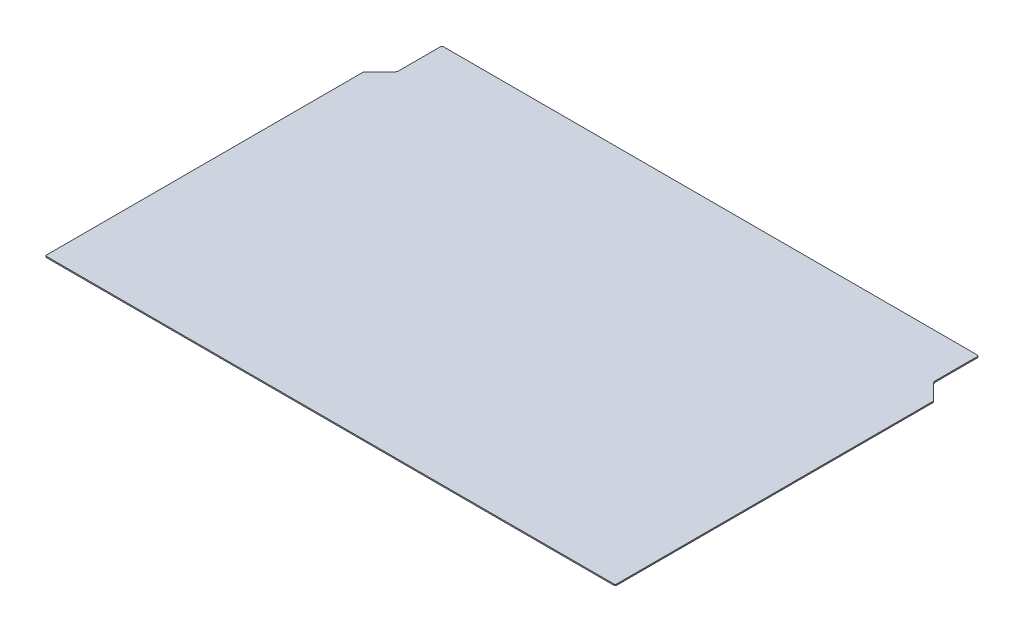
ISO-10303-21;
HEADER;
FILE_DESCRIPTION(('STEP AP214'),'2;1');
FILE_NAME('part.step','',(''),(''),'','','');
FILE_SCHEMA(('AUTOMOTIVE_DESIGN { 1 0 10303 214 1 1 1 1 }'));
ENDSEC;
DATA;
#1=APPLICATION_CONTEXT('core data for automotive mechanical design processes');
#2=APPLICATION_PROTOCOL_DEFINITION('international standard','automotive_design',2000,#1);
#3=PRODUCT_CONTEXT('',#1,'mechanical');
#4=PRODUCT('Part','Part','',(#3));
#5=PRODUCT_RELATED_PRODUCT_CATEGORY('part','',(#4));
#6=PRODUCT_DEFINITION_FORMATION('','',#4);
#7=PRODUCT_DEFINITION_CONTEXT('part definition',#1,'design');
#8=PRODUCT_DEFINITION('design','',#6,#7);
#9=PRODUCT_DEFINITION_SHAPE('','',#8);
#10=(LENGTH_UNIT() NAMED_UNIT(*) SI_UNIT(.MILLI.,.METRE.));
#11=(NAMED_UNIT(*) PLANE_ANGLE_UNIT() SI_UNIT($,.RADIAN.));
#12=(NAMED_UNIT(*) SI_UNIT($,.STERADIAN.) SOLID_ANGLE_UNIT());
#13=UNCERTAINTY_MEASURE_WITH_UNIT(LENGTH_MEASURE(1.E-05),#10,'distance_accuracy_value','');
#14=(GEOMETRIC_REPRESENTATION_CONTEXT(3) GLOBAL_UNCERTAINTY_ASSIGNED_CONTEXT((#13)) GLOBAL_UNIT_ASSIGNED_CONTEXT((#10,
#11,#12)) REPRESENTATION_CONTEXT('',''));
#15=CARTESIAN_POINT('',(0.,0.,0.));
#16=DIRECTION('',(0.,0.,1.));
#17=DIRECTION('',(1.,0.,0.));
#18=AXIS2_PLACEMENT_3D('',#15,#16,#17);
#19=CARTESIAN_POINT('',(758.825,3.175,-341.584871939465));
#20=DIRECTION('',(0.,-1.,0.));
#21=DIRECTION('',(0.,0.,-1.));
#22=AXIS2_PLACEMENT_3D('',#19,#20,#21);
#23=CYLINDRICAL_SURFACE('',#22,3.17500000000005);
#24=CARTESIAN_POINT('',(758.825,0.,-341.584871939465));
#25=DIRECTION('',(0.,1.,0.));
#26=DIRECTION('',(0.,0.,-1.));
#27=AXIS2_PLACEMENT_3D('',#24,#25,#26);
#28=CIRCLE('',#27,3.17500000000005);
#29=CARTESIAN_POINT('',(762.,0.,-341.584871939465));
#30=VERTEX_POINT('',#29);
#31=CARTESIAN_POINT('',(761.070064030267,0.,-343.829935969733));
#32=VERTEX_POINT('',#31);
#33=EDGE_CURVE('E179',#30,#32,#28,.T.);
#34=ORIENTED_EDGE('',*,*,#33,.T.);
#35=DIRECTION('',(0.,-1.,0.));
#36=VECTOR('',#35,1.);
#37=CARTESIAN_POINT('',(761.070064030267,3.175,-343.829935969733));
#38=LINE('',#37,#36);
#39=CARTESIAN_POINT('',(761.070064030267,3.175,-343.829935969733));
#40=VERTEX_POINT('',#39);
#41=EDGE_CURVE('E11',#40,#32,#38,.T.);
#42=ORIENTED_EDGE('',*,*,#41,.F.);
#43=CARTESIAN_POINT('',(758.825,3.175,-341.584871939465));
#44=DIRECTION('',(0.,1.,0.));
#45=DIRECTION('',(0.,0.,-1.));
#46=AXIS2_PLACEMENT_3D('',#43,#44,#45);
#47=CIRCLE('',#46,3.17500000000005);
#48=CARTESIAN_POINT('',(762.,3.175,-341.584871939465));
#49=VERTEX_POINT('',#48);
#50=EDGE_CURVE('E209',#49,#40,#47,.T.);
#51=ORIENTED_EDGE('',*,*,#50,.F.);
#52=DIRECTION('',(0.,-1.,0.));
#53=VECTOR('',#52,1.);
#54=CARTESIAN_POINT('',(762.,3.175,-341.584871939465));
#55=LINE('',#54,#53);
#56=EDGE_CURVE('E175',#49,#30,#55,.T.);
#57=ORIENTED_EDGE('',*,*,#56,.T.);
#58=EDGE_LOOP('',(#34,#42,#51,#57));
#59=FACE_BOUND('',#58,.T.);
#60=ADVANCED_FACE('F35',(#59),#23,.T.);
#61=CARTESIAN_POINT('',(761.070064030267,3.175,-343.829935969733));
#62=DIRECTION('',(-0.707106781186549,0.,0.707106781186546));
#63=DIRECTION('',(0.707106781186546,0.,0.707106781186549));
#64=AXIS2_PLACEMENT_3D('',#61,#62,#63);
#65=PLANE('',#64);
#66=DIRECTION('',(-0.707106781186546,0.,-0.707106781186549));
#67=VECTOR('',#66,1.);
#68=CARTESIAN_POINT('',(761.070064030267,0.,-343.829935969733));
#69=LINE('',#68,#67);
#70=CARTESIAN_POINT('',(721.269743878931,0.,-383.630256121069));
#71=VERTEX_POINT('',#70);
#72=EDGE_CURVE('E182',#32,#71,#69,.T.);
#73=ORIENTED_EDGE('',*,*,#72,.T.);
#74=DIRECTION('',(0.,-1.,0.));
#75=VECTOR('',#74,1.);
#76=CARTESIAN_POINT('',(721.269743878931,3.175,-383.630256121069));
#77=LINE('',#76,#75);
#78=CARTESIAN_POINT('',(721.269743878931,3.175,-383.630256121069));
#79=VERTEX_POINT('',#78);
#80=EDGE_CURVE('E43',#79,#71,#77,.T.);
#81=ORIENTED_EDGE('',*,*,#80,.F.);
#82=DIRECTION('',(-0.707106781186546,0.,-0.707106781186549));
#83=VECTOR('',#82,1.);
#84=CARTESIAN_POINT('',(761.070064030267,3.175,-343.829935969733));
#85=LINE('',#84,#83);
#86=EDGE_CURVE('E118',#40,#79,#85,.T.);
#87=ORIENTED_EDGE('',*,*,#86,.F.);
#88=ORIENTED_EDGE('',*,*,#41,.T.);
#89=EDGE_LOOP('',(#73,#81,#87,#88));
#90=FACE_BOUND('',#89,.T.);
#91=ADVANCED_FACE('F307',(#90),#65,.F.);
#92=CARTESIAN_POINT('',(730.25,3.175,-392.610512242138));
#93=DIRECTION('',(0.,-1.,0.));
#94=DIRECTION('',(0.,0.,-1.));
#95=AXIS2_PLACEMENT_3D('',#92,#93,#94);
#96=CYLINDRICAL_SURFACE('',#95,12.7000000000001);
#97=CARTESIAN_POINT('',(730.25,0.,-392.610512242138));
#98=DIRECTION('',(0.,-1.,0.));
#99=DIRECTION('',(0.,0.,1.));
#100=AXIS2_PLACEMENT_3D('',#97,#98,#99);
#101=CIRCLE('',#100,12.7000000000001);
#102=CARTESIAN_POINT('',(717.55,0.,-392.610512242138));
#103=VERTEX_POINT('',#102);
#104=EDGE_CURVE('E184',#71,#103,#101,.T.);
#105=ORIENTED_EDGE('',*,*,#104,.T.);
#106=DIRECTION('',(0.,-1.,0.));
#107=VECTOR('',#106,1.);
#108=CARTESIAN_POINT('',(717.55,3.175,-392.610512242138));
#109=LINE('',#108,#107);
#110=CARTESIAN_POINT('',(717.55,3.175,-392.610512242138));
#111=VERTEX_POINT('',#110);
#112=EDGE_CURVE('E240',#111,#103,#109,.T.);
#113=ORIENTED_EDGE('',*,*,#112,.F.);
#114=CARTESIAN_POINT('',(730.25,3.175,-392.610512242138));
#115=DIRECTION('',(0.,-1.,0.));
#116=DIRECTION('',(0.,0.,1.));
#117=AXIS2_PLACEMENT_3D('',#114,#115,#116);
#118=CIRCLE('',#117,12.7000000000001);
#119=EDGE_CURVE('E248',#79,#111,#118,.T.);
#120=ORIENTED_EDGE('',*,*,#119,.F.);
#121=ORIENTED_EDGE('',*,*,#80,.T.);
#122=EDGE_LOOP('',(#105,#113,#120,#121));
#123=FACE_BOUND('',#122,.T.);
#124=ADVANCED_FACE('F246',(#123),#96,.F.);
#125=CARTESIAN_POINT('',(717.55,3.175,-504.825));
#126=DIRECTION('',(-1.,0.,0.));
#127=DIRECTION('',(0.,0.,1.));
#128=AXIS2_PLACEMENT_3D('',#125,#126,#127);
#129=PLANE('',#128);
#130=DIRECTION('',(0.,0.,-1.));
#131=VECTOR('',#130,1.);
#132=CARTESIAN_POINT('',(717.55,0.,-504.825));
#133=LINE('',#132,#131);
#134=CARTESIAN_POINT('',(717.55,0.,-504.825));
#135=VERTEX_POINT('',#134);
#136=EDGE_CURVE('E186',#103,#135,#133,.T.);
#137=ORIENTED_EDGE('',*,*,#136,.T.);
#138=DIRECTION('',(0.,-1.,0.));
#139=VECTOR('',#138,1.);
#140=CARTESIAN_POINT('',(717.55,3.175,-504.825));
#141=LINE('',#140,#139);
#142=CARTESIAN_POINT('',(717.55,3.175,-504.825));
#143=VERTEX_POINT('',#142);
#144=EDGE_CURVE('E237',#143,#135,#141,.T.);
#145=ORIENTED_EDGE('',*,*,#144,.F.);
#146=DIRECTION('',(0.,0.,-1.));
#147=VECTOR('',#146,1.);
#148=CARTESIAN_POINT('',(717.55,3.175,-504.825));
#149=LINE('',#148,#147);
#150=EDGE_CURVE('E266',#111,#143,#149,.T.);
#151=ORIENTED_EDGE('',*,*,#150,.F.);
#152=ORIENTED_EDGE('',*,*,#112,.T.);
#153=EDGE_LOOP('',(#137,#145,#151,#152));
#154=FACE_BOUND('',#153,.T.);
#155=ADVANCED_FACE('F257',(#154),#129,.F.);
#156=CARTESIAN_POINT('',(714.375,3.175,-504.825));
#157=DIRECTION('',(0.,-1.,0.));
#158=DIRECTION('',(0.,0.,-1.));
#159=AXIS2_PLACEMENT_3D('',#156,#157,#158);
#160=CYLINDRICAL_SURFACE('',#159,3.17500000000004);
#161=CARTESIAN_POINT('',(714.375,0.,-504.825));
#162=DIRECTION('',(0.,1.,0.));
#163=DIRECTION('',(0.,0.,1.));
#164=AXIS2_PLACEMENT_3D('',#161,#162,#163);
#165=CIRCLE('',#164,3.17500000000004);
#166=CARTESIAN_POINT('',(714.375,0.,-508.));
#167=VERTEX_POINT('',#166);
#168=EDGE_CURVE('E188',#135,#167,#165,.T.);
#169=ORIENTED_EDGE('',*,*,#168,.T.);
#170=DIRECTION('',(0.,-1.,0.));
#171=VECTOR('',#170,1.);
#172=CARTESIAN_POINT('',(714.375,3.175,-508.));
#173=LINE('',#172,#171);
#174=CARTESIAN_POINT('',(714.375,3.175,-508.));
#175=VERTEX_POINT('',#174);
#176=EDGE_CURVE('E234',#175,#167,#173,.T.);
#177=ORIENTED_EDGE('',*,*,#176,.F.);
#178=CARTESIAN_POINT('',(714.375,3.175,-504.825));
#179=DIRECTION('',(0.,1.,0.));
#180=DIRECTION('',(0.,0.,1.));
#181=AXIS2_PLACEMENT_3D('',#178,#179,#180);
#182=CIRCLE('',#181,3.17500000000004);
#183=EDGE_CURVE('E263',#143,#175,#182,.T.);
#184=ORIENTED_EDGE('',*,*,#183,.F.);
#185=ORIENTED_EDGE('',*,*,#144,.T.);
#186=EDGE_LOOP('',(#169,#177,#184,#185));
#187=FACE_BOUND('',#186,.T.);
#188=ADVANCED_FACE('F261',(#187),#160,.T.);
#189=CARTESIAN_POINT('',(-714.375,3.175,-508.));
#190=DIRECTION('',(0.,0.,1.));
#191=DIRECTION('',(1.,0.,0.));
#192=AXIS2_PLACEMENT_3D('',#189,#190,#191);
#193=PLANE('',#192);
#194=DIRECTION('',(-1.,0.,0.));
#195=VECTOR('',#194,1.);
#196=CARTESIAN_POINT('',(-714.375,0.,-508.));
#197=LINE('',#196,#195);
#198=CARTESIAN_POINT('',(-714.375,0.,-508.));
#199=VERTEX_POINT('',#198);
#200=EDGE_CURVE('E190',#167,#199,#197,.T.);
#201=ORIENTED_EDGE('',*,*,#200,.T.);
#202=DIRECTION('',(0.,-1.,0.));
#203=VECTOR('',#202,1.);
#204=CARTESIAN_POINT('',(-714.375,3.175,-508.));
#205=LINE('',#204,#203);
#206=CARTESIAN_POINT('',(-714.375,3.175,-508.));
#207=VERTEX_POINT('',#206);
#208=EDGE_CURVE('E231',#207,#199,#205,.T.);
#209=ORIENTED_EDGE('',*,*,#208,.F.);
#210=DIRECTION('',(-1.,0.,0.));
#211=VECTOR('',#210,1.);
#212=CARTESIAN_POINT('',(-714.375,3.175,-508.));
#213=LINE('',#212,#211);
#214=EDGE_CURVE('E265',#175,#207,#213,.T.);
#215=ORIENTED_EDGE('',*,*,#214,.F.);
#216=ORIENTED_EDGE('',*,*,#176,.T.);
#217=EDGE_LOOP('',(#201,#209,#215,#216));
#218=FACE_BOUND('',#217,.T.);
#219=ADVANCED_FACE('F320',(#218),#193,.F.);
#220=CARTESIAN_POINT('',(-714.375,3.175,-504.825));
#221=DIRECTION('',(0.,-1.,0.));
#222=DIRECTION('',(0.,0.,-1.));
#223=AXIS2_PLACEMENT_3D('',#220,#221,#222);
#224=CYLINDRICAL_SURFACE('',#223,3.17500000000004);
#225=CARTESIAN_POINT('',(-714.375,0.,-504.825));
#226=DIRECTION('',(0.,1.,0.));
#227=DIRECTION('',(0.,0.,-1.));
#228=AXIS2_PLACEMENT_3D('',#225,#226,#227);
#229=CIRCLE('',#228,3.17500000000004);
#230=CARTESIAN_POINT('',(-717.55,0.,-504.825));
#231=VERTEX_POINT('',#230);
#232=EDGE_CURVE('E192',#199,#231,#229,.T.);
#233=ORIENTED_EDGE('',*,*,#232,.T.);
#234=DIRECTION('',(0.,-1.,0.));
#235=VECTOR('',#234,1.);
#236=CARTESIAN_POINT('',(-717.55,3.175,-504.825));
#237=LINE('',#236,#235);
#238=CARTESIAN_POINT('',(-717.55,3.175,-504.825));
#239=VERTEX_POINT('',#238);
#240=EDGE_CURVE('E228',#239,#231,#237,.T.);
#241=ORIENTED_EDGE('',*,*,#240,.F.);
#242=CARTESIAN_POINT('',(-714.375,3.175,-504.825));
#243=DIRECTION('',(0.,1.,0.));
#244=DIRECTION('',(0.,0.,-1.));
#245=AXIS2_PLACEMENT_3D('',#242,#243,#244);
#246=CIRCLE('',#245,3.17500000000004);
#247=EDGE_CURVE('E268',#207,#239,#246,.T.);
#248=ORIENTED_EDGE('',*,*,#247,.F.);
#249=ORIENTED_EDGE('',*,*,#208,.T.);
#250=EDGE_LOOP('',(#233,#241,#248,#249));
#251=FACE_BOUND('',#250,.T.);
#252=ADVANCED_FACE('F323',(#251),#224,.T.);
#253=CARTESIAN_POINT('',(-717.55,3.175,-504.825));
#254=DIRECTION('',(1.,0.,0.));
#255=DIRECTION('',(0.,0.,-1.));
#256=AXIS2_PLACEMENT_3D('',#253,#254,#255);
#257=PLANE('',#256);
#258=DIRECTION('',(0.,0.,1.));
#259=VECTOR('',#258,1.);
#260=CARTESIAN_POINT('',(-717.55,0.,-504.825));
#261=LINE('',#260,#259);
#262=CARTESIAN_POINT('',(-717.55,0.,-392.610512242138));
#263=VERTEX_POINT('',#262);
#264=EDGE_CURVE('E194',#231,#263,#261,.T.);
#265=ORIENTED_EDGE('',*,*,#264,.T.);
#266=DIRECTION('',(0.,-1.,0.));
#267=VECTOR('',#266,1.);
#268=CARTESIAN_POINT('',(-717.55,3.175,-392.610512242138));
#269=LINE('',#268,#267);
#270=CARTESIAN_POINT('',(-717.55,3.175,-392.610512242138));
#271=VERTEX_POINT('',#270);
#272=EDGE_CURVE('E225',#271,#263,#269,.T.);
#273=ORIENTED_EDGE('',*,*,#272,.F.);
#274=DIRECTION('',(0.,0.,1.));
#275=VECTOR('',#274,1.);
#276=CARTESIAN_POINT('',(-717.55,3.175,-504.825));
#277=LINE('',#276,#275);
#278=EDGE_CURVE('E274',#239,#271,#277,.T.);
#279=ORIENTED_EDGE('',*,*,#278,.F.);
#280=ORIENTED_EDGE('',*,*,#240,.T.);
#281=EDGE_LOOP('',(#265,#273,#279,#280));
#282=FACE_BOUND('',#281,.T.);
#283=ADVANCED_FACE('F327',(#282),#257,.F.);
#284=CARTESIAN_POINT('',(-730.25,3.175,-392.610512242138));
#285=DIRECTION('',(0.,-1.,0.));
#286=DIRECTION('',(0.,0.,-1.));
#287=AXIS2_PLACEMENT_3D('',#284,#285,#286);
#288=CYLINDRICAL_SURFACE('',#287,12.7);
#289=CARTESIAN_POINT('',(-730.25,0.,-392.610512242138));
#290=DIRECTION('',(0.,-1.,0.));
#291=DIRECTION('',(0.,0.,1.));
#292=AXIS2_PLACEMENT_3D('',#289,#290,#291);
#293=CIRCLE('',#292,12.7);
#294=CARTESIAN_POINT('',(-721.269743878931,0.,-383.630256121069));
#295=VERTEX_POINT('',#294);
#296=EDGE_CURVE('E196',#263,#295,#293,.T.);
#297=ORIENTED_EDGE('',*,*,#296,.T.);
#298=DIRECTION('',(0.,-1.,0.));
#299=VECTOR('',#298,1.);
#300=CARTESIAN_POINT('',(-721.269743878931,3.175,-383.630256121069));
#301=LINE('',#300,#299);
#302=CARTESIAN_POINT('',(-721.269743878931,3.175,-383.630256121069));
#303=VERTEX_POINT('',#302);
#304=EDGE_CURVE('E222',#303,#295,#301,.T.);
#305=ORIENTED_EDGE('',*,*,#304,.F.);
#306=CARTESIAN_POINT('',(-730.25,3.175,-392.610512242138));
#307=DIRECTION('',(0.,-1.,0.));
#308=DIRECTION('',(0.,0.,1.));
#309=AXIS2_PLACEMENT_3D('',#306,#307,#308);
#310=CIRCLE('',#309,12.7);
#311=EDGE_CURVE('E276',#271,#303,#310,.T.);
#312=ORIENTED_EDGE('',*,*,#311,.F.);
#313=ORIENTED_EDGE('',*,*,#272,.T.);
#314=EDGE_LOOP('',(#297,#305,#312,#313));
#315=FACE_BOUND('',#314,.T.);
#316=ADVANCED_FACE('F331',(#315),#288,.F.);
#317=CARTESIAN_POINT('',(-761.070064030267,3.175,-343.829935969733));
#318=DIRECTION('',(0.707106781186547,0.,0.707106781186548));
#319=DIRECTION('',(0.707106781186548,0.,-0.707106781186547));
#320=AXIS2_PLACEMENT_3D('',#317,#318,#319);
#321=PLANE('',#320);
#322=DIRECTION('',(-0.707106781186549,0.,0.707106781186547));
#323=VECTOR('',#322,1.);
#324=CARTESIAN_POINT('',(-761.070064030267,0.,-343.829935969733));
#325=LINE('',#324,#323);
#326=CARTESIAN_POINT('',(-761.070064030267,0.,-343.829935969733));
#327=VERTEX_POINT('',#326);
#328=EDGE_CURVE('E198',#295,#327,#325,.T.);
#329=ORIENTED_EDGE('',*,*,#328,.T.);
#330=DIRECTION('',(0.,-1.,0.));
#331=VECTOR('',#330,1.);
#332=CARTESIAN_POINT('',(-761.070064030267,3.175,-343.829935969733));
#333=LINE('',#332,#331);
#334=CARTESIAN_POINT('',(-761.070064030267,3.175,-343.829935969733));
#335=VERTEX_POINT('',#334);
#336=EDGE_CURVE('E219',#335,#327,#333,.T.);
#337=ORIENTED_EDGE('',*,*,#336,.F.);
#338=DIRECTION('',(-0.707106781186549,0.,0.707106781186547));
#339=VECTOR('',#338,1.);
#340=CARTESIAN_POINT('',(-761.070064030267,3.175,-343.829935969733));
#341=LINE('',#340,#339);
#342=EDGE_CURVE('E278',#303,#335,#341,.T.);
#343=ORIENTED_EDGE('',*,*,#342,.F.);
#344=ORIENTED_EDGE('',*,*,#304,.T.);
#345=EDGE_LOOP('',(#329,#337,#343,#344));
#346=FACE_BOUND('',#345,.T.);
#347=ADVANCED_FACE('F335',(#346),#321,.F.);
#348=CARTESIAN_POINT('',(-758.825,3.175,-341.584871939465));
#349=DIRECTION('',(0.,-1.,0.));
#350=DIRECTION('',(0.,0.,-1.));
#351=AXIS2_PLACEMENT_3D('',#348,#349,#350);
#352=CYLINDRICAL_SURFACE('',#351,3.17500000000005);
#353=CARTESIAN_POINT('',(-758.825,0.,-341.584871939465));
#354=DIRECTION('',(0.,1.,0.));
#355=DIRECTION('',(0.,0.,1.));
#356=AXIS2_PLACEMENT_3D('',#353,#354,#355);
#357=CIRCLE('',#356,3.17500000000005);
#358=CARTESIAN_POINT('',(-762.,0.,-341.584871939465));
#359=VERTEX_POINT('',#358);
#360=EDGE_CURVE('E200',#327,#359,#357,.T.);
#361=ORIENTED_EDGE('',*,*,#360,.T.);
#362=DIRECTION('',(0.,-1.,0.));
#363=VECTOR('',#362,1.);
#364=CARTESIAN_POINT('',(-762.,3.175,-341.584871939465));
#365=LINE('',#364,#363);
#366=CARTESIAN_POINT('',(-762.,3.175,-341.584871939465));
#367=VERTEX_POINT('',#366);
#368=EDGE_CURVE('E216',#367,#359,#365,.T.);
#369=ORIENTED_EDGE('',*,*,#368,.F.);
#370=CARTESIAN_POINT('',(-758.825,3.175,-341.584871939465));
#371=DIRECTION('',(0.,1.,0.));
#372=DIRECTION('',(0.,0.,1.));
#373=AXIS2_PLACEMENT_3D('',#370,#371,#372);
#374=CIRCLE('',#373,3.17500000000005);
#375=EDGE_CURVE('E280',#335,#367,#374,.T.);
#376=ORIENTED_EDGE('',*,*,#375,.F.);
#377=ORIENTED_EDGE('',*,*,#336,.T.);
#378=EDGE_LOOP('',(#361,#369,#376,#377));
#379=FACE_BOUND('',#378,.T.);
#380=ADVANCED_FACE('F339',(#379),#352,.T.);
#381=CARTESIAN_POINT('',(-762.,3.175,504.825));
#382=DIRECTION('',(1.,0.,0.));
#383=DIRECTION('',(0.,0.,-1.));
#384=AXIS2_PLACEMENT_3D('',#381,#382,#383);
#385=PLANE('',#384);
#386=DIRECTION('',(0.,0.,1.));
#387=VECTOR('',#386,1.);
#388=CARTESIAN_POINT('',(-762.,0.,504.825));
#389=LINE('',#388,#387);
#390=CARTESIAN_POINT('',(-762.,0.,504.825));
#391=VERTEX_POINT('',#390);
#392=EDGE_CURVE('E202',#359,#391,#389,.T.);
#393=ORIENTED_EDGE('',*,*,#392,.T.);
#394=DIRECTION('',(0.,-1.,0.));
#395=VECTOR('',#394,1.);
#396=CARTESIAN_POINT('',(-762.,3.175,504.825));
#397=LINE('',#396,#395);
#398=CARTESIAN_POINT('',(-762.,3.175,504.825));
#399=VERTEX_POINT('',#398);
#400=EDGE_CURVE('E213',#399,#391,#397,.T.);
#401=ORIENTED_EDGE('',*,*,#400,.F.);
#402=DIRECTION('',(0.,0.,1.));
#403=VECTOR('',#402,1.);
#404=CARTESIAN_POINT('',(-762.,3.175,504.825));
#405=LINE('',#404,#403);
#406=EDGE_CURVE('E282',#367,#399,#405,.T.);
#407=ORIENTED_EDGE('',*,*,#406,.F.);
#408=ORIENTED_EDGE('',*,*,#368,.T.);
#409=EDGE_LOOP('',(#393,#401,#407,#408));
#410=FACE_BOUND('',#409,.T.);
#411=ADVANCED_FACE('F288',(#410),#385,.F.);
#412=CARTESIAN_POINT('',(-758.825,3.175,504.825));
#413=DIRECTION('',(0.,-1.,0.));
#414=DIRECTION('',(0.,0.,-1.));
#415=AXIS2_PLACEMENT_3D('',#412,#413,#414);
#416=CYLINDRICAL_SURFACE('',#415,3.17500000000004);
#417=CARTESIAN_POINT('',(-758.825,0.,504.825));
#418=DIRECTION('',(0.,1.,0.));
#419=DIRECTION('',(0.,0.,-1.));
#420=AXIS2_PLACEMENT_3D('',#417,#418,#419);
#421=CIRCLE('',#420,3.17500000000004);
#422=CARTESIAN_POINT('',(-758.825,0.,508.));
#423=VERTEX_POINT('',#422);
#424=EDGE_CURVE('E204',#391,#423,#421,.T.);
#425=ORIENTED_EDGE('',*,*,#424,.T.);
#426=DIRECTION('',(0.,-1.,0.));
#427=VECTOR('',#426,1.);
#428=CARTESIAN_POINT('',(-758.825,3.175,508.));
#429=LINE('',#428,#427);
#430=CARTESIAN_POINT('',(-758.825,3.175,508.));
#431=VERTEX_POINT('',#430);
#432=EDGE_CURVE('E170',#431,#423,#429,.T.);
#433=ORIENTED_EDGE('',*,*,#432,.F.);
#434=CARTESIAN_POINT('',(-758.825,3.175,504.825));
#435=DIRECTION('',(0.,1.,0.));
#436=DIRECTION('',(0.,0.,-1.));
#437=AXIS2_PLACEMENT_3D('',#434,#435,#436);
#438=CIRCLE('',#437,3.17500000000004);
#439=EDGE_CURVE('E161',#399,#431,#438,.T.);
#440=ORIENTED_EDGE('',*,*,#439,.F.);
#441=ORIENTED_EDGE('',*,*,#400,.T.);
#442=EDGE_LOOP('',(#425,#433,#440,#441));
#443=FACE_BOUND('',#442,.T.);
#444=ADVANCED_FACE('F292',(#443),#416,.T.);
#445=CARTESIAN_POINT('',(-758.825,3.175,508.));
#446=DIRECTION('',(0.,0.,-1.));
#447=DIRECTION('',(-1.,0.,0.));
#448=AXIS2_PLACEMENT_3D('',#445,#446,#447);
#449=PLANE('',#448);
#450=DIRECTION('',(1.,0.,0.));
#451=VECTOR('',#450,1.);
#452=CARTESIAN_POINT('',(-758.825,0.,508.));
#453=LINE('',#452,#451);
#454=CARTESIAN_POINT('',(758.825,0.,508.));
#455=VERTEX_POINT('',#454);
#456=EDGE_CURVE('E169',#423,#455,#453,.T.);
#457=ORIENTED_EDGE('',*,*,#456,.T.);
#458=DIRECTION('',(0.,-1.,0.));
#459=VECTOR('',#458,1.);
#460=CARTESIAN_POINT('',(758.825,3.175,508.));
#461=LINE('',#460,#459);
#462=CARTESIAN_POINT('',(758.825,3.175,508.));
#463=VERTEX_POINT('',#462);
#464=EDGE_CURVE('E166',#463,#455,#461,.T.);
#465=ORIENTED_EDGE('',*,*,#464,.F.);
#466=DIRECTION('',(1.,0.,0.));
#467=VECTOR('',#466,1.);
#468=CARTESIAN_POINT('',(-758.825,3.175,508.));
#469=LINE('',#468,#467);
#470=EDGE_CURVE('E155',#431,#463,#469,.T.);
#471=ORIENTED_EDGE('',*,*,#470,.F.);
#472=ORIENTED_EDGE('',*,*,#432,.T.);
#473=EDGE_LOOP('',(#457,#465,#471,#472));
#474=FACE_BOUND('',#473,.T.);
#475=ADVANCED_FACE('F167',(#474),#449,.F.);
#476=CARTESIAN_POINT('',(758.825,3.175,504.825));
#477=DIRECTION('',(0.,-1.,0.));
#478=DIRECTION('',(0.,0.,-1.));
#479=AXIS2_PLACEMENT_3D('',#476,#477,#478);
#480=CYLINDRICAL_SURFACE('',#479,3.17500000000004);
#481=CARTESIAN_POINT('',(758.825,0.,504.825));
#482=DIRECTION('',(0.,1.,0.));
#483=DIRECTION('',(0.,0.,1.));
#484=AXIS2_PLACEMENT_3D('',#481,#482,#483);
#485=CIRCLE('',#484,3.17500000000004);
#486=CARTESIAN_POINT('',(762.,0.,504.825));
#487=VERTEX_POINT('',#486);
#488=EDGE_CURVE('E104',#455,#487,#485,.T.);
#489=ORIENTED_EDGE('',*,*,#488,.T.);
#490=DIRECTION('',(0.,-1.,0.));
#491=VECTOR('',#490,1.);
#492=CARTESIAN_POINT('',(762.,3.175,504.825));
#493=LINE('',#492,#491);
#494=CARTESIAN_POINT('',(762.,3.175,504.825));
#495=VERTEX_POINT('',#494);
#496=EDGE_CURVE('E171',#495,#487,#493,.T.);
#497=ORIENTED_EDGE('',*,*,#496,.F.);
#498=CARTESIAN_POINT('',(758.825,3.175,504.825));
#499=DIRECTION('',(0.,1.,0.));
#500=DIRECTION('',(0.,0.,1.));
#501=AXIS2_PLACEMENT_3D('',#498,#499,#500);
#502=CIRCLE('',#501,3.17500000000004);
#503=EDGE_CURVE('E159',#463,#495,#502,.T.);
#504=ORIENTED_EDGE('',*,*,#503,.F.);
#505=ORIENTED_EDGE('',*,*,#464,.T.);
#506=EDGE_LOOP('',(#489,#497,#504,#505));
#507=FACE_BOUND('',#506,.T.);
#508=ADVANCED_FACE('F173',(#507),#480,.T.);
#509=CARTESIAN_POINT('',(762.,3.175,504.825));
#510=DIRECTION('',(-1.,0.,0.));
#511=DIRECTION('',(0.,0.,1.));
#512=AXIS2_PLACEMENT_3D('',#509,#510,#511);
#513=PLANE('',#512);
#514=DIRECTION('',(0.,0.,-1.));
#515=VECTOR('',#514,1.);
#516=CARTESIAN_POINT('',(762.,0.,504.825));
#517=LINE('',#516,#515);
#518=EDGE_CURVE('E110',#487,#30,#517,.T.);
#519=ORIENTED_EDGE('',*,*,#518,.T.);
#520=ORIENTED_EDGE('',*,*,#56,.F.);
#521=DIRECTION('',(0.,0.,-1.));
#522=VECTOR('',#521,1.);
#523=CARTESIAN_POINT('',(762.,3.175,504.825));
#524=LINE('',#523,#522);
#525=EDGE_CURVE('E51',#495,#49,#524,.T.);
#526=ORIENTED_EDGE('',*,*,#525,.F.);
#527=ORIENTED_EDGE('',*,*,#496,.T.);
#528=EDGE_LOOP('',(#519,#520,#526,#527));
#529=FACE_BOUND('',#528,.T.);
#530=ADVANCED_FACE('F296',(#529),#513,.F.);
#531=CARTESIAN_POINT('',(758.825,3.175,-341.584871939465));
#532=DIRECTION('',(0.,-1.,0.));
#533=DIRECTION('',(0.,0.,-1.));
#534=AXIS2_PLACEMENT_3D('',#531,#532,#533);
#535=PLANE('',#534);
#536=ORIENTED_EDGE('',*,*,#50,.T.);
#537=ORIENTED_EDGE('',*,*,#86,.T.);
#538=ORIENTED_EDGE('',*,*,#119,.T.);
#539=ORIENTED_EDGE('',*,*,#150,.T.);
#540=ORIENTED_EDGE('',*,*,#183,.T.);
#541=ORIENTED_EDGE('',*,*,#214,.T.);
#542=ORIENTED_EDGE('',*,*,#247,.T.);
#543=ORIENTED_EDGE('',*,*,#278,.T.);
#544=ORIENTED_EDGE('',*,*,#311,.T.);
#545=ORIENTED_EDGE('',*,*,#342,.T.);
#546=ORIENTED_EDGE('',*,*,#375,.T.);
#547=ORIENTED_EDGE('',*,*,#406,.T.);
#548=ORIENTED_EDGE('',*,*,#439,.T.);
#549=ORIENTED_EDGE('',*,*,#470,.T.);
#550=ORIENTED_EDGE('',*,*,#503,.T.);
#551=ORIENTED_EDGE('',*,*,#525,.T.);
#552=EDGE_LOOP('',(#536,#537,#538,#539,#540,#541,#542,#543,#544,#545,#546,#547,#548,#549,#550,#551));
#553=FACE_BOUND('',#552,.T.);
#554=ADVANCED_FACE('F157',(#553),#535,.F.);
#555=CARTESIAN_POINT('',(758.825,0.,-341.584871939465));
#556=DIRECTION('',(0.,-1.,0.));
#557=DIRECTION('',(0.,0.,-1.));
#558=AXIS2_PLACEMENT_3D('',#555,#556,#557);
#559=PLANE('',#558);
#560=ORIENTED_EDGE('',*,*,#33,.F.);
#561=ORIENTED_EDGE('',*,*,#518,.F.);
#562=ORIENTED_EDGE('',*,*,#488,.F.);
#563=ORIENTED_EDGE('',*,*,#456,.F.);
#564=ORIENTED_EDGE('',*,*,#424,.F.);
#565=ORIENTED_EDGE('',*,*,#392,.F.);
#566=ORIENTED_EDGE('',*,*,#360,.F.);
#567=ORIENTED_EDGE('',*,*,#328,.F.);
#568=ORIENTED_EDGE('',*,*,#296,.F.);
#569=ORIENTED_EDGE('',*,*,#264,.F.);
#570=ORIENTED_EDGE('',*,*,#232,.F.);
#571=ORIENTED_EDGE('',*,*,#200,.F.);
#572=ORIENTED_EDGE('',*,*,#168,.F.);
#573=ORIENTED_EDGE('',*,*,#136,.F.);
#574=ORIENTED_EDGE('',*,*,#104,.F.);
#575=ORIENTED_EDGE('',*,*,#72,.F.);
#576=EDGE_LOOP('',(#560,#561,#562,#563,#564,#565,#566,#567,#568,#569,#570,#571,#572,#573,#574,#575));
#577=FACE_BOUND('',#576,.T.);
#578=ADVANCED_FACE('F252',(#577),#559,.T.);
#579=CLOSED_SHELL('',(#60,#91,#124,#155,#188,#219,#252,#283,#316,#347,#380,#411,#444,#475,#508,
#530,#554,#578));
#580=MANIFOLD_SOLID_BREP('B2',#579);
#581=ADVANCED_BREP_SHAPE_REPRESENTATION('',(#18,#580),#14);
#582=SHAPE_DEFINITION_REPRESENTATION(#9,#581);
ENDSEC;
END-ISO-10303-21;
